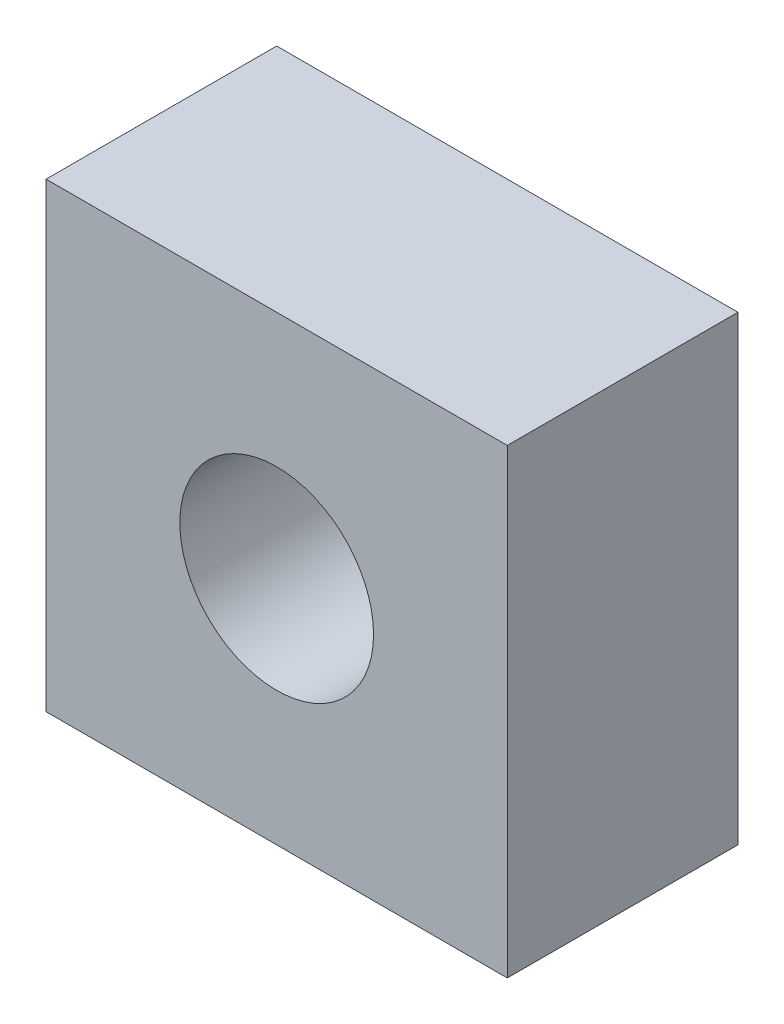
ISO-10303-21;
HEADER;
FILE_DESCRIPTION(('STEP AP214'),'2;1');
FILE_NAME('part.step','',(''),(''),'','','');
FILE_SCHEMA(('AUTOMOTIVE_DESIGN { 1 0 10303 214 1 1 1 1 }'));
ENDSEC;
DATA;
#1=APPLICATION_CONTEXT('core data for automotive mechanical design processes');
#2=APPLICATION_PROTOCOL_DEFINITION('international standard','automotive_design',2000,#1);
#3=PRODUCT_CONTEXT('',#1,'mechanical');
#4=PRODUCT('Part','Part','',(#3));
#5=PRODUCT_RELATED_PRODUCT_CATEGORY('part','',(#4));
#6=PRODUCT_DEFINITION_FORMATION('','',#4);
#7=PRODUCT_DEFINITION_CONTEXT('part definition',#1,'design');
#8=PRODUCT_DEFINITION('design','',#6,#7);
#9=PRODUCT_DEFINITION_SHAPE('','',#8);
#10=(LENGTH_UNIT() NAMED_UNIT(*) SI_UNIT(.MILLI.,.METRE.));
#11=(NAMED_UNIT(*) PLANE_ANGLE_UNIT() SI_UNIT($,.RADIAN.));
#12=(NAMED_UNIT(*) SI_UNIT($,.STERADIAN.) SOLID_ANGLE_UNIT());
#13=UNCERTAINTY_MEASURE_WITH_UNIT(LENGTH_MEASURE(1.E-05),#10,'distance_accuracy_value','');
#14=(GEOMETRIC_REPRESENTATION_CONTEXT(3) GLOBAL_UNCERTAINTY_ASSIGNED_CONTEXT((#13)) GLOBAL_UNIT_ASSIGNED_CONTEXT((#10,
#11,#12)) REPRESENTATION_CONTEXT('',''));
#15=CARTESIAN_POINT('',(0.,0.,0.));
#16=DIRECTION('',(0.,0.,1.));
#17=DIRECTION('',(1.,0.,0.));
#18=AXIS2_PLACEMENT_3D('',#15,#16,#17);
#19=CARTESIAN_POINT('',(0.,0.,5.));
#20=DIRECTION('',(0.,0.,1.));
#21=DIRECTION('',(1.,0.,0.));
#22=AXIS2_PLACEMENT_3D('',#19,#20,#21);
#23=PLANE('',#22);
#24=DIRECTION('',(0.,1.,0.));
#25=VECTOR('',#24,1.);
#26=CARTESIAN_POINT('',(0.,0.,5.));
#27=LINE('',#26,#25);
#28=CARTESIAN_POINT('',(0.,0.,5.));
#29=VERTEX_POINT('',#28);
#30=CARTESIAN_POINT('',(0.,10.,5.));
#31=VERTEX_POINT('',#30);
#32=EDGE_CURVE('E92',#29,#31,#27,.T.);
#33=ORIENTED_EDGE('',*,*,#32,.T.);
#34=DIRECTION('',(-1.,0.,0.));
#35=VECTOR('',#34,1.);
#36=CARTESIAN_POINT('',(0.,10.,5.));
#37=LINE('',#36,#35);
#38=CARTESIAN_POINT('',(-10.,10.,5.));
#39=VERTEX_POINT('',#38);
#40=EDGE_CURVE('E87',#31,#39,#37,.T.);
#41=ORIENTED_EDGE('',*,*,#40,.T.);
#42=DIRECTION('',(0.,-1.,0.));
#43=VECTOR('',#42,1.);
#44=CARTESIAN_POINT('',(-10.,0.,5.));
#45=LINE('',#44,#43);
#46=CARTESIAN_POINT('',(-10.,0.,5.));
#47=VERTEX_POINT('',#46);
#48=EDGE_CURVE('E90',#39,#47,#45,.T.);
#49=ORIENTED_EDGE('',*,*,#48,.T.);
#50=DIRECTION('',(1.,0.,0.));
#51=VECTOR('',#50,1.);
#52=CARTESIAN_POINT('',(0.,0.,5.));
#53=LINE('',#52,#51);
#54=EDGE_CURVE('E57',#47,#29,#53,.T.);
#55=ORIENTED_EDGE('',*,*,#54,.T.);
#56=EDGE_LOOP('',(#33,#41,#49,#55));
#57=FACE_BOUND('',#56,.T.);
#58=CARTESIAN_POINT('',(-5.,5.,5.));
#59=DIRECTION('',(0.,0.,1.));
#60=DIRECTION('',(1.,0.,0.));
#61=AXIS2_PLACEMENT_3D('',#58,#59,#60);
#62=CIRCLE('',#61,2.1);
#63=CARTESIAN_POINT('',(-2.9,5.,5.));
#64=VERTEX_POINT('',#63);
#65=EDGE_CURVE('E114',#64,#64,#62,.T.);
#66=ORIENTED_EDGE('',*,*,#65,.F.);
#67=EDGE_LOOP('',(#66));
#68=FACE_BOUND('',#67,.T.);
#69=ADVANCED_FACE('F40',(#57,#68),#23,.T.);
#70=CARTESIAN_POINT('',(0.,0.,0.));
#71=DIRECTION('',(0.,0.,1.));
#72=DIRECTION('',(1.,0.,0.));
#73=AXIS2_PLACEMENT_3D('',#70,#71,#72);
#74=PLANE('',#73);
#75=DIRECTION('',(0.,1.,0.));
#76=VECTOR('',#75,1.);
#77=CARTESIAN_POINT('',(0.,0.,0.));
#78=LINE('',#77,#76);
#79=CARTESIAN_POINT('',(0.,0.,0.));
#80=VERTEX_POINT('',#79);
#81=CARTESIAN_POINT('',(0.,10.,0.));
#82=VERTEX_POINT('',#81);
#83=EDGE_CURVE('E117',#80,#82,#78,.T.);
#84=ORIENTED_EDGE('',*,*,#83,.F.);
#85=DIRECTION('',(1.,0.,0.));
#86=VECTOR('',#85,1.);
#87=CARTESIAN_POINT('',(0.,0.,0.));
#88=LINE('',#87,#86);
#89=CARTESIAN_POINT('',(-10.,0.,0.));
#90=VERTEX_POINT('',#89);
#91=EDGE_CURVE('E80',#90,#80,#88,.T.);
#92=ORIENTED_EDGE('',*,*,#91,.F.);
#93=DIRECTION('',(0.,-1.,0.));
#94=VECTOR('',#93,1.);
#95=CARTESIAN_POINT('',(-10.,0.,0.));
#96=LINE('',#95,#94);
#97=CARTESIAN_POINT('',(-10.,10.,0.));
#98=VERTEX_POINT('',#97);
#99=EDGE_CURVE('E74',#98,#90,#96,.T.);
#100=ORIENTED_EDGE('',*,*,#99,.F.);
#101=DIRECTION('',(-1.,0.,0.));
#102=VECTOR('',#101,1.);
#103=CARTESIAN_POINT('',(0.,10.,0.));
#104=LINE('',#103,#102);
#105=EDGE_CURVE('E96',#82,#98,#104,.T.);
#106=ORIENTED_EDGE('',*,*,#105,.F.);
#107=EDGE_LOOP('',(#84,#92,#100,#106));
#108=FACE_BOUND('',#107,.T.);
#109=CARTESIAN_POINT('',(-5.,5.,0.));
#110=DIRECTION('',(0.,0.,1.));
#111=DIRECTION('',(1.,0.,0.));
#112=AXIS2_PLACEMENT_3D('',#109,#110,#111);
#113=CIRCLE('',#112,2.1);
#114=CARTESIAN_POINT('',(-2.9,5.,0.));
#115=VERTEX_POINT('',#114);
#116=EDGE_CURVE('E112',#115,#115,#113,.T.);
#117=ORIENTED_EDGE('',*,*,#116,.T.);
#118=EDGE_LOOP('',(#117));
#119=FACE_BOUND('',#118,.T.);
#120=ADVANCED_FACE('F130',(#108,#119),#74,.F.);
#121=CARTESIAN_POINT('',(0.,0.,5.));
#122=DIRECTION('',(-1.,0.,0.));
#123=DIRECTION('',(0.,-1.,0.));
#124=AXIS2_PLACEMENT_3D('',#121,#122,#123);
#125=PLANE('',#124);
#126=ORIENTED_EDGE('',*,*,#83,.T.);
#127=DIRECTION('',(0.,0.,-1.));
#128=VECTOR('',#127,1.);
#129=CARTESIAN_POINT('',(0.,10.,5.));
#130=LINE('',#129,#128);
#131=EDGE_CURVE('E12',#31,#82,#130,.T.);
#132=ORIENTED_EDGE('',*,*,#131,.F.);
#133=ORIENTED_EDGE('',*,*,#32,.F.);
#134=DIRECTION('',(0.,0.,-1.));
#135=VECTOR('',#134,1.);
#136=CARTESIAN_POINT('',(0.,0.,5.));
#137=LINE('',#136,#135);
#138=EDGE_CURVE('E100',#29,#80,#137,.T.);
#139=ORIENTED_EDGE('',*,*,#138,.T.);
#140=EDGE_LOOP('',(#126,#132,#133,#139));
#141=FACE_BOUND('',#140,.T.);
#142=ADVANCED_FACE('F42',(#141),#125,.F.);
#143=CARTESIAN_POINT('',(0.,10.,5.));
#144=DIRECTION('',(0.,-1.,0.));
#145=DIRECTION('',(1.,0.,0.));
#146=AXIS2_PLACEMENT_3D('',#143,#144,#145);
#147=PLANE('',#146);
#148=ORIENTED_EDGE('',*,*,#105,.T.);
#149=DIRECTION('',(0.,0.,-1.));
#150=VECTOR('',#149,1.);
#151=CARTESIAN_POINT('',(-10.,10.,5.));
#152=LINE('',#151,#150);
#153=EDGE_CURVE('E49',#39,#98,#152,.T.);
#154=ORIENTED_EDGE('',*,*,#153,.F.);
#155=ORIENTED_EDGE('',*,*,#40,.F.);
#156=ORIENTED_EDGE('',*,*,#131,.T.);
#157=EDGE_LOOP('',(#148,#154,#155,#156));
#158=FACE_BOUND('',#157,.T.);
#159=ADVANCED_FACE('F95',(#158),#147,.F.);
#160=CARTESIAN_POINT('',(-10.,0.,5.));
#161=DIRECTION('',(1.,0.,0.));
#162=DIRECTION('',(0.,0.,-1.));
#163=AXIS2_PLACEMENT_3D('',#160,#161,#162);
#164=PLANE('',#163);
#165=ORIENTED_EDGE('',*,*,#99,.T.);
#166=DIRECTION('',(0.,0.,-1.));
#167=VECTOR('',#166,1.);
#168=CARTESIAN_POINT('',(-10.,0.,5.));
#169=LINE('',#168,#167);
#170=EDGE_CURVE('E97',#47,#90,#169,.T.);
#171=ORIENTED_EDGE('',*,*,#170,.F.);
#172=ORIENTED_EDGE('',*,*,#48,.F.);
#173=ORIENTED_EDGE('',*,*,#153,.T.);
#174=EDGE_LOOP('',(#165,#171,#172,#173));
#175=FACE_BOUND('',#174,.T.);
#176=ADVANCED_FACE('F98',(#175),#164,.F.);
#177=CARTESIAN_POINT('',(0.,0.,5.));
#178=DIRECTION('',(0.,1.,0.));
#179=DIRECTION('',(0.,0.,1.));
#180=AXIS2_PLACEMENT_3D('',#177,#178,#179);
#181=PLANE('',#180);
#182=ORIENTED_EDGE('',*,*,#91,.T.);
#183=ORIENTED_EDGE('',*,*,#138,.F.);
#184=ORIENTED_EDGE('',*,*,#54,.F.);
#185=ORIENTED_EDGE('',*,*,#170,.T.);
#186=EDGE_LOOP('',(#182,#183,#184,#185));
#187=FACE_BOUND('',#186,.T.);
#188=ADVANCED_FACE('F128',(#187),#181,.F.);
#189=CARTESIAN_POINT('',(-5.,5.,5.));
#190=DIRECTION('',(0.,0.,-1.));
#191=DIRECTION('',(-1.,0.,0.));
#192=AXIS2_PLACEMENT_3D('',#189,#190,#191);
#193=CYLINDRICAL_SURFACE('',#192,2.1);
#194=ORIENTED_EDGE('',*,*,#65,.T.);
#195=EDGE_LOOP('',(#194));
#196=FACE_BOUND('',#195,.T.);
#197=ORIENTED_EDGE('',*,*,#116,.F.);
#198=EDGE_LOOP('',(#197));
#199=FACE_BOUND('',#198,.T.);
#200=ADVANCED_FACE('F143',(#196,#199),#193,.F.);
#201=CLOSED_SHELL('',(#69,#120,#142,#159,#176,#188,#200));
#202=MANIFOLD_SOLID_BREP('B2',#201);
#203=ADVANCED_BREP_SHAPE_REPRESENTATION('',(#18,#202),#14);
#204=SHAPE_DEFINITION_REPRESENTATION(#9,#203);
ENDSEC;
END-ISO-10303-21;
